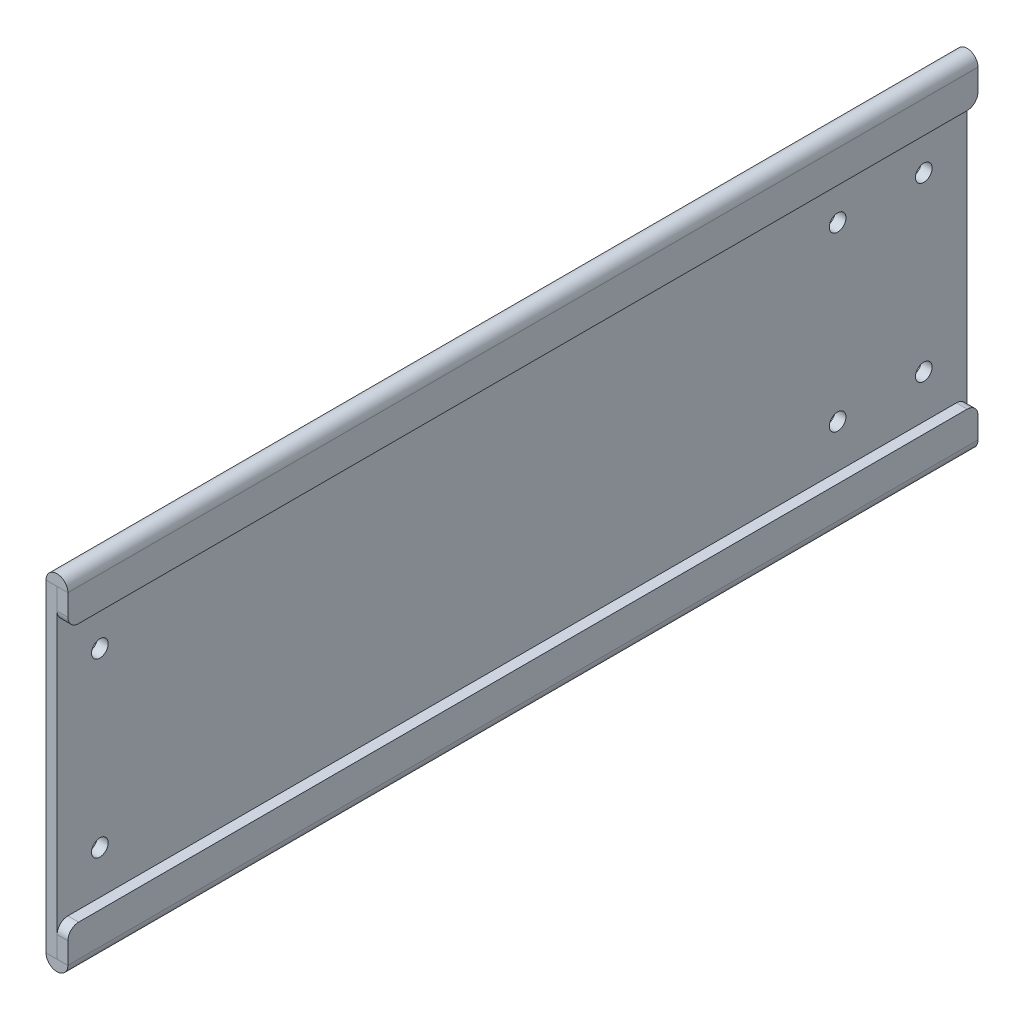
ISO-10303-21;
HEADER;
FILE_DESCRIPTION(('STEP AP214'),'2;1');
FILE_NAME('part.step','',(''),(''),'','','');
FILE_SCHEMA(('AUTOMOTIVE_DESIGN { 1 0 10303 214 1 1 1 1 }'));
ENDSEC;
DATA;
#1=APPLICATION_CONTEXT('core data for automotive mechanical design processes');
#2=APPLICATION_PROTOCOL_DEFINITION('international standard','automotive_design',2000,#1);
#3=PRODUCT_CONTEXT('',#1,'mechanical');
#4=PRODUCT('Part','Part','',(#3));
#5=PRODUCT_RELATED_PRODUCT_CATEGORY('part','',(#4));
#6=PRODUCT_DEFINITION_FORMATION('','',#4);
#7=PRODUCT_DEFINITION_CONTEXT('part definition',#1,'design');
#8=PRODUCT_DEFINITION('design','',#6,#7);
#9=PRODUCT_DEFINITION_SHAPE('','',#8);
#10=(LENGTH_UNIT() NAMED_UNIT(*) SI_UNIT(.MILLI.,.METRE.));
#11=(NAMED_UNIT(*) PLANE_ANGLE_UNIT() SI_UNIT($,.RADIAN.));
#12=(NAMED_UNIT(*) SI_UNIT($,.STERADIAN.) SOLID_ANGLE_UNIT());
#13=UNCERTAINTY_MEASURE_WITH_UNIT(LENGTH_MEASURE(1.E-05),#10,'distance_accuracy_value','');
#14=(GEOMETRIC_REPRESENTATION_CONTEXT(3) GLOBAL_UNCERTAINTY_ASSIGNED_CONTEXT((#13)) GLOBAL_UNIT_ASSIGNED_CONTEXT((#10,
#11,#12)) REPRESENTATION_CONTEXT('',''));
#15=CARTESIAN_POINT('',(0.,0.,0.));
#16=DIRECTION('',(0.,0.,1.));
#17=DIRECTION('',(1.,0.,0.));
#18=AXIS2_PLACEMENT_3D('',#15,#16,#17);
#19=CARTESIAN_POINT('',(0.,101.6,-268.22908));
#20=DIRECTION('',(0.,0.,-1.));
#21=DIRECTION('',(-1.,0.,0.));
#22=AXIS2_PLACEMENT_3D('',#19,#20,#21);
#23=PLANE('',#22);
#24=DIRECTION('',(0.,-1.,0.));
#25=VECTOR('',#24,1.);
#26=CARTESIAN_POINT('',(3.175,101.6,-268.22908));
#27=LINE('',#26,#25);
#28=CARTESIAN_POINT('',(3.175,98.375,-268.22908));
#29=VERTEX_POINT('',#28);
#30=CARTESIAN_POINT('',(3.175,3.22500000000001,-268.22908));
#31=VERTEX_POINT('',#30);
#32=EDGE_CURVE('E208',#29,#31,#27,.T.);
#33=ORIENTED_EDGE('',*,*,#32,.T.);
#34=DIRECTION('',(-1.,0.,0.));
#35=VECTOR('',#34,1.);
#36=CARTESIAN_POINT('',(3.175,3.225,-268.22908));
#37=LINE('',#36,#35);
#38=CARTESIAN_POINT('',(0.,3.22500000000003,-268.22908));
#39=VERTEX_POINT('',#38);
#40=EDGE_CURVE('E173',#31,#39,#37,.T.);
#41=ORIENTED_EDGE('',*,*,#40,.T.);
#42=DIRECTION('',(0.,-1.,0.));
#43=VECTOR('',#42,1.);
#44=CARTESIAN_POINT('',(0.,101.6,-268.22908));
#45=LINE('',#44,#43);
#46=CARTESIAN_POINT('',(0.,98.375,-268.22908));
#47=VERTEX_POINT('',#46);
#48=EDGE_CURVE('E193',#47,#39,#45,.T.);
#49=ORIENTED_EDGE('',*,*,#48,.F.);
#50=DIRECTION('',(-1.,0.,0.));
#51=VECTOR('',#50,1.);
#52=CARTESIAN_POINT('',(3.175,98.375,-268.22908));
#53=LINE('',#52,#51);
#54=EDGE_CURVE('E280',#29,#47,#53,.T.);
#55=ORIENTED_EDGE('',*,*,#54,.F.);
#56=EDGE_LOOP('',(#33,#41,#49,#55));
#57=FACE_BOUND('',#56,.T.);
#58=ADVANCED_FACE('F42',(#57),#23,.T.);
#59=CARTESIAN_POINT('',(3.175,101.6,0.));
#60=DIRECTION('',(0.,0.,1.));
#61=DIRECTION('',(1.,0.,0.));
#62=AXIS2_PLACEMENT_3D('',#59,#60,#61);
#63=PLANE('',#62);
#64=DIRECTION('',(-1.,0.,0.));
#65=VECTOR('',#64,1.);
#66=CARTESIAN_POINT('',(3.175,3.225,0.));
#67=LINE('',#66,#65);
#68=CARTESIAN_POINT('',(3.175,3.225,0.));
#69=VERTEX_POINT('',#68);
#70=CARTESIAN_POINT('',(0.,3.22500000000003,0.));
#71=VERTEX_POINT('',#70);
#72=EDGE_CURVE('E160',#69,#71,#67,.T.);
#73=ORIENTED_EDGE('',*,*,#72,.F.);
#74=DIRECTION('',(0.,-1.,0.));
#75=VECTOR('',#74,1.);
#76=CARTESIAN_POINT('',(3.175,101.6,0.));
#77=LINE('',#76,#75);
#78=CARTESIAN_POINT('',(3.175,98.375,0.));
#79=VERTEX_POINT('',#78);
#80=EDGE_CURVE('E203',#79,#69,#77,.T.);
#81=ORIENTED_EDGE('',*,*,#80,.F.);
#82=DIRECTION('',(-1.,0.,0.));
#83=VECTOR('',#82,1.);
#84=CARTESIAN_POINT('',(3.175,98.375,0.));
#85=LINE('',#84,#83);
#86=CARTESIAN_POINT('',(0.,98.375,0.));
#87=VERTEX_POINT('',#86);
#88=EDGE_CURVE('E201',#79,#87,#85,.T.);
#89=ORIENTED_EDGE('',*,*,#88,.T.);
#90=DIRECTION('',(0.,-1.,0.));
#91=VECTOR('',#90,1.);
#92=CARTESIAN_POINT('',(0.,101.6,0.));
#93=LINE('',#92,#91);
#94=EDGE_CURVE('E191',#87,#71,#93,.T.);
#95=ORIENTED_EDGE('',*,*,#94,.T.);
#96=EDGE_LOOP('',(#73,#81,#89,#95));
#97=FACE_BOUND('',#96,.T.);
#98=ADVANCED_FACE('F199',(#97),#63,.T.);
#99=CARTESIAN_POINT('',(3.175,101.6,0.));
#100=DIRECTION('',(-1.,0.,0.));
#101=DIRECTION('',(0.,0.,1.));
#102=AXIS2_PLACEMENT_3D('',#99,#100,#101);
#103=PLANE('',#102);
#104=CARTESIAN_POINT('',(3.175,25.35,-255.52908));
#105=DIRECTION('',(-1.,0.,0.));
#106=DIRECTION('',(0.,0.,1.));
#107=AXIS2_PLACEMENT_3D('',#104,#105,#106);
#108=CIRCLE('',#107,2.45745000000002);
#109=CARTESIAN_POINT('',(3.175,25.35,-253.07163));
#110=VERTEX_POINT('',#109);
#111=EDGE_CURVE('E405',#110,#110,#108,.T.);
#112=ORIENTED_EDGE('',*,*,#111,.T.);
#113=EDGE_LOOP('',(#112));
#114=FACE_BOUND('',#113,.T.);
#115=CARTESIAN_POINT('',(3.175,25.35,-230.12908));
#116=DIRECTION('',(-1.,0.,0.));
#117=DIRECTION('',(0.,0.,1.));
#118=AXIS2_PLACEMENT_3D('',#115,#116,#117);
#119=CIRCLE('',#118,2.45744999999999);
#120=CARTESIAN_POINT('',(3.175,25.35,-227.67163));
#121=VERTEX_POINT('',#120);
#122=EDGE_CURVE('E415',#121,#121,#119,.T.);
#123=ORIENTED_EDGE('',*,*,#122,.T.);
#124=EDGE_LOOP('',(#123));
#125=FACE_BOUND('',#124,.T.);
#126=CARTESIAN_POINT('',(3.175,76.15,-230.12908));
#127=DIRECTION('',(-1.,0.,0.));
#128=DIRECTION('',(0.,0.,1.));
#129=AXIS2_PLACEMENT_3D('',#126,#127,#128);
#130=CIRCLE('',#129,2.45744999999999);
#131=CARTESIAN_POINT('',(3.175,76.15,-227.67163));
#132=VERTEX_POINT('',#131);
#133=EDGE_CURVE('E419',#132,#132,#130,.T.);
#134=ORIENTED_EDGE('',*,*,#133,.T.);
#135=EDGE_LOOP('',(#134));
#136=FACE_BOUND('',#135,.T.);
#137=CARTESIAN_POINT('',(3.175,76.15,-12.7));
#138=DIRECTION('',(-1.,0.,0.));
#139=DIRECTION('',(0.,0.,1.));
#140=AXIS2_PLACEMENT_3D('',#137,#138,#139);
#141=CIRCLE('',#140,2.45745);
#142=CARTESIAN_POINT('',(3.175,76.15,-10.24255));
#143=VERTEX_POINT('',#142);
#144=EDGE_CURVE('E423',#143,#143,#141,.T.);
#145=ORIENTED_EDGE('',*,*,#144,.T.);
#146=EDGE_LOOP('',(#145));
#147=FACE_BOUND('',#146,.T.);
#148=CARTESIAN_POINT('',(3.175,25.35,-12.7));
#149=DIRECTION('',(-1.,0.,0.));
#150=DIRECTION('',(0.,0.,1.));
#151=AXIS2_PLACEMENT_3D('',#148,#149,#150);
#152=CIRCLE('',#151,2.45745);
#153=CARTESIAN_POINT('',(3.175,25.35,-10.24255));
#154=VERTEX_POINT('',#153);
#155=EDGE_CURVE('E427',#154,#154,#152,.T.);
#156=ORIENTED_EDGE('',*,*,#155,.T.);
#157=EDGE_LOOP('',(#156));
#158=FACE_BOUND('',#157,.T.);
#159=CARTESIAN_POINT('',(3.175,76.15,-255.52908));
#160=DIRECTION('',(-1.,0.,0.));
#161=DIRECTION('',(0.,0.,1.));
#162=AXIS2_PLACEMENT_3D('',#159,#160,#161);
#163=CIRCLE('',#162,2.45745000000002);
#164=CARTESIAN_POINT('',(3.175,76.15,-253.07163));
#165=VERTEX_POINT('',#164);
#166=EDGE_CURVE('E431',#165,#165,#163,.T.);
#167=ORIENTED_EDGE('',*,*,#166,.T.);
#168=EDGE_LOOP('',(#167));
#169=FACE_BOUND('',#168,.T.);
#170=ORIENTED_EDGE('',*,*,#80,.T.);
#171=DIRECTION('',(0.,0.,-1.));
#172=VECTOR('',#171,1.);
#173=CARTESIAN_POINT('',(3.175,3.225,-268.22908));
#174=LINE('',#173,#172);
#175=EDGE_CURVE('E404',#31,#69,#174,.F.);
#176=ORIENTED_EDGE('',*,*,#175,.F.);
#177=ORIENTED_EDGE('',*,*,#32,.F.);
#178=DIRECTION('',(0.,0.,1.));
#179=VECTOR('',#178,1.);
#180=CARTESIAN_POINT('',(3.175,98.375,0.));
#181=LINE('',#180,#179);
#182=EDGE_CURVE('E349',#79,#29,#181,.F.);
#183=ORIENTED_EDGE('',*,*,#182,.F.);
#184=EDGE_LOOP('',(#170,#176,#177,#183));
#185=FACE_BOUND('',#184,.T.);
#186=ADVANCED_FACE('F467',(#114,#125,#136,#147,#158,#169,#185),#103,.F.);
#187=CARTESIAN_POINT('',(0.,101.6,0.));
#188=DIRECTION('',(-1.,0.,0.));
#189=DIRECTION('',(0.,0.,1.));
#190=AXIS2_PLACEMENT_3D('',#187,#188,#189);
#191=PLANE('',#190);
#192=CARTESIAN_POINT('',(0.,25.35,-255.52908));
#193=DIRECTION('',(-1.,0.,0.));
#194=DIRECTION('',(0.,0.,1.));
#195=AXIS2_PLACEMENT_3D('',#192,#193,#194);
#196=CIRCLE('',#195,2.45745000000002);
#197=CARTESIAN_POINT('',(0.,25.35,-253.07163));
#198=VERTEX_POINT('',#197);
#199=EDGE_CURVE('E439',#198,#198,#196,.T.);
#200=ORIENTED_EDGE('',*,*,#199,.F.);
#201=EDGE_LOOP('',(#200));
#202=FACE_BOUND('',#201,.T.);
#203=CARTESIAN_POINT('',(0.,25.35,-230.12908));
#204=DIRECTION('',(-1.,0.,0.));
#205=DIRECTION('',(0.,0.,1.));
#206=AXIS2_PLACEMENT_3D('',#203,#204,#205);
#207=CIRCLE('',#206,2.45744999999999);
#208=CARTESIAN_POINT('',(0.,25.35,-227.67163));
#209=VERTEX_POINT('',#208);
#210=EDGE_CURVE('E449',#209,#209,#207,.T.);
#211=ORIENTED_EDGE('',*,*,#210,.F.);
#212=EDGE_LOOP('',(#211));
#213=FACE_BOUND('',#212,.T.);
#214=CARTESIAN_POINT('',(0.,76.15,-230.12908));
#215=DIRECTION('',(-1.,0.,0.));
#216=DIRECTION('',(0.,0.,1.));
#217=AXIS2_PLACEMENT_3D('',#214,#215,#216);
#218=CIRCLE('',#217,2.45744999999999);
#219=CARTESIAN_POINT('',(0.,76.15,-227.67163));
#220=VERTEX_POINT('',#219);
#221=EDGE_CURVE('E444',#220,#220,#218,.T.);
#222=ORIENTED_EDGE('',*,*,#221,.F.);
#223=EDGE_LOOP('',(#222));
#224=FACE_BOUND('',#223,.T.);
#225=CARTESIAN_POINT('',(0.,76.15,-12.7));
#226=DIRECTION('',(-1.,0.,0.));
#227=DIRECTION('',(0.,0.,1.));
#228=AXIS2_PLACEMENT_3D('',#225,#226,#227);
#229=CIRCLE('',#228,2.45745);
#230=CARTESIAN_POINT('',(0.,76.15,-10.24255));
#231=VERTEX_POINT('',#230);
#232=EDGE_CURVE('E440',#231,#231,#229,.T.);
#233=ORIENTED_EDGE('',*,*,#232,.F.);
#234=EDGE_LOOP('',(#233));
#235=FACE_BOUND('',#234,.T.);
#236=CARTESIAN_POINT('',(0.,25.35,-12.7));
#237=DIRECTION('',(-1.,0.,0.));
#238=DIRECTION('',(0.,0.,1.));
#239=AXIS2_PLACEMENT_3D('',#236,#237,#238);
#240=CIRCLE('',#239,2.45745);
#241=CARTESIAN_POINT('',(0.,25.35,-10.24255));
#242=VERTEX_POINT('',#241);
#243=EDGE_CURVE('E445',#242,#242,#240,.T.);
#244=ORIENTED_EDGE('',*,*,#243,.F.);
#245=EDGE_LOOP('',(#244));
#246=FACE_BOUND('',#245,.T.);
#247=CARTESIAN_POINT('',(0.,76.15,-255.52908));
#248=DIRECTION('',(-1.,0.,0.));
#249=DIRECTION('',(0.,0.,1.));
#250=AXIS2_PLACEMENT_3D('',#247,#248,#249);
#251=CIRCLE('',#250,2.45745000000002);
#252=CARTESIAN_POINT('',(0.,76.15,-253.07163));
#253=VERTEX_POINT('',#252);
#254=EDGE_CURVE('E435',#253,#253,#251,.T.);
#255=ORIENTED_EDGE('',*,*,#254,.F.);
#256=EDGE_LOOP('',(#255));
#257=FACE_BOUND('',#256,.T.);
#258=DIRECTION('',(0.,0.,-1.));
#259=VECTOR('',#258,1.);
#260=CARTESIAN_POINT('',(0.,3.22500000000003,-268.22908));
#261=LINE('',#260,#259);
#262=EDGE_CURVE('E180',#39,#71,#261,.F.);
#263=ORIENTED_EDGE('',*,*,#262,.T.);
#264=ORIENTED_EDGE('',*,*,#94,.F.);
#265=DIRECTION('',(0.,0.,1.));
#266=VECTOR('',#265,1.);
#267=CARTESIAN_POINT('',(0.,98.375,0.));
#268=LINE('',#267,#266);
#269=EDGE_CURVE('E336',#87,#47,#268,.F.);
#270=ORIENTED_EDGE('',*,*,#269,.T.);
#271=ORIENTED_EDGE('',*,*,#48,.T.);
#272=EDGE_LOOP('',(#263,#264,#270,#271));
#273=FACE_BOUND('',#272,.T.);
#274=ADVANCED_FACE('F189',(#202,#213,#224,#235,#246,#257,#273),#191,.T.);
#275=CARTESIAN_POINT('',(6.45,93.6375,0.));
#276=DIRECTION('',(0.,0.,-1.));
#277=DIRECTION('',(0.,1.,0.));
#278=AXIS2_PLACEMENT_3D('',#275,#276,#277);
#279=PLANE('',#278);
#280=DIRECTION('',(0.,1.,0.));
#281=VECTOR('',#280,1.);
#282=CARTESIAN_POINT('',(3.275,93.6375,0.));
#283=LINE('',#282,#281);
#284=CARTESIAN_POINT('',(3.275,92.075,0.));
#285=VERTEX_POINT('',#284);
#286=CARTESIAN_POINT('',(3.275,98.375,0.));
#287=VERTEX_POINT('',#286);
#288=EDGE_CURVE('E315',#285,#287,#283,.T.);
#289=ORIENTED_EDGE('',*,*,#288,.F.);
#290=DIRECTION('',(-1.,0.,0.));
#291=VECTOR('',#290,1.);
#292=CARTESIAN_POINT('',(6.45,92.075,0.));
#293=LINE('',#292,#291);
#294=CARTESIAN_POINT('',(6.45,92.075,0.));
#295=VERTEX_POINT('',#294);
#296=EDGE_CURVE('E217',#285,#295,#293,.F.);
#297=ORIENTED_EDGE('',*,*,#296,.T.);
#298=DIRECTION('',(0.,1.,0.));
#299=VECTOR('',#298,1.);
#300=CARTESIAN_POINT('',(6.45,93.6375,0.));
#301=LINE('',#300,#299);
#302=CARTESIAN_POINT('',(6.45,98.375,0.));
#303=VERTEX_POINT('',#302);
#304=EDGE_CURVE('E296',#295,#303,#301,.T.);
#305=ORIENTED_EDGE('',*,*,#304,.T.);
#306=DIRECTION('',(1.,0.,0.));
#307=VECTOR('',#306,1.);
#308=CARTESIAN_POINT('',(6.45,98.375,0.));
#309=LINE('',#308,#307);
#310=EDGE_CURVE('E295',#287,#303,#309,.T.);
#311=ORIENTED_EDGE('',*,*,#310,.F.);
#312=EDGE_LOOP('',(#289,#297,#305,#311));
#313=FACE_BOUND('',#312,.T.);
#314=ADVANCED_FACE('F466',(#313),#279,.F.);
#315=CARTESIAN_POINT('',(6.45,88.9,-134.11454));
#316=DIRECTION('',(0.,1.,0.));
#317=DIRECTION('',(0.,0.,1.));
#318=AXIS2_PLACEMENT_3D('',#315,#316,#317);
#319=PLANE('',#318);
#320=DIRECTION('',(0.,0.,1.));
#321=VECTOR('',#320,1.);
#322=CARTESIAN_POINT('',(6.45,88.9,-134.11454));
#323=LINE('',#322,#321);
#324=CARTESIAN_POINT('',(6.45,88.9,-265.05408));
#325=VERTEX_POINT('',#324);
#326=CARTESIAN_POINT('',(6.45,88.9,-3.17500000000001));
#327=VERTEX_POINT('',#326);
#328=EDGE_CURVE('E288',#325,#327,#323,.T.);
#329=ORIENTED_EDGE('',*,*,#328,.T.);
#330=DIRECTION('',(-1.,0.,0.));
#331=VECTOR('',#330,1.);
#332=CARTESIAN_POINT('',(6.45,88.9,-3.17500000000001));
#333=LINE('',#332,#331);
#334=CARTESIAN_POINT('',(3.275,88.9,-3.17500000000001));
#335=VERTEX_POINT('',#334);
#336=EDGE_CURVE('E231',#327,#335,#333,.T.);
#337=ORIENTED_EDGE('',*,*,#336,.T.);
#338=DIRECTION('',(0.,0.,-1.));
#339=VECTOR('',#338,1.);
#340=CARTESIAN_POINT('',(3.275,88.9,-134.11454));
#341=LINE('',#340,#339);
#342=CARTESIAN_POINT('',(3.275,88.9,-265.05408));
#343=VERTEX_POINT('',#342);
#344=EDGE_CURVE('E290',#343,#335,#341,.F.);
#345=ORIENTED_EDGE('',*,*,#344,.F.);
#346=DIRECTION('',(-1.,0.,0.));
#347=VECTOR('',#346,1.);
#348=CARTESIAN_POINT('',(6.45,88.9,-265.05408));
#349=LINE('',#348,#347);
#350=EDGE_CURVE('E227',#343,#325,#349,.F.);
#351=ORIENTED_EDGE('',*,*,#350,.T.);
#352=EDGE_LOOP('',(#329,#337,#345,#351));
#353=FACE_BOUND('',#352,.T.);
#354=ADVANCED_FACE('F287',(#353),#319,.F.);
#355=CARTESIAN_POINT('',(6.45,93.6375,-268.22908));
#356=DIRECTION('',(0.,0.,1.));
#357=DIRECTION('',(0.,-1.,0.));
#358=AXIS2_PLACEMENT_3D('',#355,#356,#357);
#359=PLANE('',#358);
#360=DIRECTION('',(0.,-1.,0.));
#361=VECTOR('',#360,1.);
#362=CARTESIAN_POINT('',(6.45,93.6375,-268.22908));
#363=LINE('',#362,#361);
#364=CARTESIAN_POINT('',(6.45,98.375,-268.22908));
#365=VERTEX_POINT('',#364);
#366=CARTESIAN_POINT('',(6.45,92.075,-268.22908));
#367=VERTEX_POINT('',#366);
#368=EDGE_CURVE('E270',#365,#367,#363,.T.);
#369=ORIENTED_EDGE('',*,*,#368,.T.);
#370=DIRECTION('',(-1.,0.,0.));
#371=VECTOR('',#370,1.);
#372=CARTESIAN_POINT('',(6.45,92.075,-268.22908));
#373=LINE('',#372,#371);
#374=CARTESIAN_POINT('',(3.275,92.075,-268.22908));
#375=VERTEX_POINT('',#374);
#376=EDGE_CURVE('E51',#367,#375,#373,.T.);
#377=ORIENTED_EDGE('',*,*,#376,.T.);
#378=DIRECTION('',(0.,1.,0.));
#379=VECTOR('',#378,1.);
#380=CARTESIAN_POINT('',(3.275,93.6375,-268.22908));
#381=LINE('',#380,#379);
#382=CARTESIAN_POINT('',(3.275,98.375,-268.22908));
#383=VERTEX_POINT('',#382);
#384=EDGE_CURVE('E268',#383,#375,#381,.F.);
#385=ORIENTED_EDGE('',*,*,#384,.F.);
#386=DIRECTION('',(1.,0.,0.));
#387=VECTOR('',#386,1.);
#388=CARTESIAN_POINT('',(6.45,98.375,-268.22908));
#389=LINE('',#388,#387);
#390=EDGE_CURVE('E210',#383,#365,#389,.T.);
#391=ORIENTED_EDGE('',*,*,#390,.T.);
#392=EDGE_LOOP('',(#369,#377,#385,#391));
#393=FACE_BOUND('',#392,.T.);
#394=ADVANCED_FACE('F266',(#393),#359,.F.);
#395=CARTESIAN_POINT('',(6.45,93.6375,-134.11454));
#396=DIRECTION('',(1.,0.,0.));
#397=DIRECTION('',(0.,0.,-1.));
#398=AXIS2_PLACEMENT_3D('',#395,#396,#397);
#399=PLANE('',#398);
#400=ORIENTED_EDGE('',*,*,#304,.F.);
#401=CARTESIAN_POINT('',(6.45,92.075,-3.175));
#402=DIRECTION('',(1.,0.,0.));
#403=DIRECTION('',(0.,0.,-1.));
#404=AXIS2_PLACEMENT_3D('',#401,#402,#403);
#405=CIRCLE('',#404,3.175);
#406=EDGE_CURVE('E224',#295,#327,#405,.T.);
#407=ORIENTED_EDGE('',*,*,#406,.T.);
#408=ORIENTED_EDGE('',*,*,#328,.F.);
#409=CARTESIAN_POINT('',(6.45,92.075,-265.05408));
#410=DIRECTION('',(1.,0.,0.));
#411=DIRECTION('',(0.,0.,-1.));
#412=AXIS2_PLACEMENT_3D('',#409,#410,#411);
#413=CIRCLE('',#412,3.175);
#414=EDGE_CURVE('E221',#325,#367,#413,.T.);
#415=ORIENTED_EDGE('',*,*,#414,.T.);
#416=ORIENTED_EDGE('',*,*,#368,.F.);
#417=DIRECTION('',(0.,0.,-1.));
#418=VECTOR('',#417,1.);
#419=CARTESIAN_POINT('',(6.45,98.375,-134.11454));
#420=LINE('',#419,#418);
#421=EDGE_CURVE('E303',#303,#365,#420,.T.);
#422=ORIENTED_EDGE('',*,*,#421,.F.);
#423=EDGE_LOOP('',(#400,#407,#408,#415,#416,#422));
#424=FACE_BOUND('',#423,.T.);
#425=ADVANCED_FACE('F293',(#424),#399,.T.);
#426=CARTESIAN_POINT('',(3.275,93.6375,-134.11454));
#427=DIRECTION('',(1.,0.,0.));
#428=DIRECTION('',(0.,0.,-1.));
#429=AXIS2_PLACEMENT_3D('',#426,#427,#428);
#430=PLANE('',#429);
#431=ORIENTED_EDGE('',*,*,#344,.T.);
#432=CARTESIAN_POINT('',(3.275,92.075,-3.175));
#433=DIRECTION('',(1.,0.,0.));
#434=DIRECTION('',(0.,0.,-1.));
#435=AXIS2_PLACEMENT_3D('',#432,#433,#434);
#436=CIRCLE('',#435,3.175);
#437=EDGE_CURVE('E237',#335,#285,#436,.F.);
#438=ORIENTED_EDGE('',*,*,#437,.T.);
#439=ORIENTED_EDGE('',*,*,#288,.T.);
#440=DIRECTION('',(0.,0.,-1.));
#441=VECTOR('',#440,1.);
#442=CARTESIAN_POINT('',(3.275,98.375,-134.11454));
#443=LINE('',#442,#441);
#444=EDGE_CURVE('E278',#287,#383,#443,.T.);
#445=ORIENTED_EDGE('',*,*,#444,.T.);
#446=ORIENTED_EDGE('',*,*,#384,.T.);
#447=CARTESIAN_POINT('',(3.275,92.075,-265.05408));
#448=DIRECTION('',(1.,0.,0.));
#449=DIRECTION('',(0.,0.,-1.));
#450=AXIS2_PLACEMENT_3D('',#447,#448,#449);
#451=CIRCLE('',#450,3.175);
#452=EDGE_CURVE('E234',#375,#343,#451,.F.);
#453=ORIENTED_EDGE('',*,*,#452,.T.);
#454=EDGE_LOOP('',(#431,#438,#439,#445,#446,#453));
#455=FACE_BOUND('',#454,.T.);
#456=ADVANCED_FACE('F275',(#455),#430,.F.);
#457=CARTESIAN_POINT('',(3.225,98.375,-268.22908));
#458=DIRECTION('',(0.,0.,-1.));
#459=DIRECTION('',(-1.,0.,0.));
#460=AXIS2_PLACEMENT_3D('',#457,#458,#459);
#461=PLANE('',#460);
#462=ORIENTED_EDGE('',*,*,#390,.F.);
#463=CARTESIAN_POINT('',(3.225,98.375,-268.22908));
#464=DIRECTION('',(0.,0.,1.));
#465=DIRECTION('',(1.,0.,0.));
#466=AXIS2_PLACEMENT_3D('',#463,#464,#465);
#467=CIRCLE('',#466,0.0499999999999997);
#468=EDGE_CURVE('E346',#29,#383,#467,.F.);
#469=ORIENTED_EDGE('',*,*,#468,.F.);
#470=ORIENTED_EDGE('',*,*,#54,.T.);
#471=CARTESIAN_POINT('',(3.225,98.375,-268.22908));
#472=DIRECTION('',(0.,0.,1.));
#473=DIRECTION('',(1.,0.,0.));
#474=AXIS2_PLACEMENT_3D('',#471,#472,#473);
#475=CIRCLE('',#474,3.225);
#476=EDGE_CURVE('E330',#47,#365,#475,.F.);
#477=ORIENTED_EDGE('',*,*,#476,.T.);
#478=EDGE_LOOP('',(#462,#469,#470,#477));
#479=FACE_BOUND('',#478,.T.);
#480=ADVANCED_FACE('F333',(#479),#461,.T.);
#481=CARTESIAN_POINT('',(3.225,98.375,0.));
#482=DIRECTION('',(0.,0.,-1.));
#483=DIRECTION('',(-1.,0.,0.));
#484=AXIS2_PLACEMENT_3D('',#481,#482,#483);
#485=PLANE('',#484);
#486=CARTESIAN_POINT('',(3.225,98.375,0.));
#487=DIRECTION('',(0.,0.,1.));
#488=DIRECTION('',(1.,0.,0.));
#489=AXIS2_PLACEMENT_3D('',#486,#487,#488);
#490=CIRCLE('',#489,0.0499999999999997);
#491=EDGE_CURVE('E352',#287,#79,#490,.T.);
#492=ORIENTED_EDGE('',*,*,#491,.F.);
#493=ORIENTED_EDGE('',*,*,#310,.T.);
#494=CARTESIAN_POINT('',(3.225,98.375,0.));
#495=DIRECTION('',(0.,0.,1.));
#496=DIRECTION('',(1.,0.,0.));
#497=AXIS2_PLACEMENT_3D('',#494,#495,#496);
#498=CIRCLE('',#497,3.225);
#499=EDGE_CURVE('E332',#303,#87,#498,.T.);
#500=ORIENTED_EDGE('',*,*,#499,.T.);
#501=ORIENTED_EDGE('',*,*,#88,.F.);
#502=EDGE_LOOP('',(#492,#493,#500,#501));
#503=FACE_BOUND('',#502,.T.);
#504=ADVANCED_FACE('F695',(#503),#485,.F.);
#505=CARTESIAN_POINT('',(3.225,98.375,0.));
#506=DIRECTION('',(0.,0.,1.));
#507=DIRECTION('',(1.,0.,0.));
#508=AXIS2_PLACEMENT_3D('',#505,#506,#507);
#509=CYLINDRICAL_SURFACE('',#508,3.225);
#510=ORIENTED_EDGE('',*,*,#269,.F.);
#511=ORIENTED_EDGE('',*,*,#499,.F.);
#512=ORIENTED_EDGE('',*,*,#421,.T.);
#513=ORIENTED_EDGE('',*,*,#476,.F.);
#514=EDGE_LOOP('',(#510,#511,#512,#513));
#515=FACE_BOUND('',#514,.T.);
#516=ADVANCED_FACE('F329',(#515),#509,.T.);
#517=CARTESIAN_POINT('',(3.225,98.375,0.));
#518=DIRECTION('',(0.,0.,1.));
#519=DIRECTION('',(1.,0.,0.));
#520=AXIS2_PLACEMENT_3D('',#517,#518,#519);
#521=CYLINDRICAL_SURFACE('',#520,0.0499999999999997);
#522=ORIENTED_EDGE('',*,*,#182,.T.);
#523=ORIENTED_EDGE('',*,*,#468,.T.);
#524=ORIENTED_EDGE('',*,*,#444,.F.);
#525=ORIENTED_EDGE('',*,*,#491,.T.);
#526=EDGE_LOOP('',(#522,#523,#524,#525));
#527=FACE_BOUND('',#526,.T.);
#528=ADVANCED_FACE('F486',(#527),#521,.F.);
#529=CARTESIAN_POINT('',(6.45,7.9625,-268.22908));
#530=DIRECTION('',(0.,0.,1.));
#531=DIRECTION('',(0.,-1.,0.));
#532=AXIS2_PLACEMENT_3D('',#529,#530,#531);
#533=PLANE('',#532);
#534=DIRECTION('',(0.,1.,0.));
#535=VECTOR('',#534,1.);
#536=CARTESIAN_POINT('',(3.275,7.9625,-268.22908));
#537=LINE('',#536,#535);
#538=CARTESIAN_POINT('',(3.275,9.525,-268.22908));
#539=VERTEX_POINT('',#538);
#540=CARTESIAN_POINT('',(3.275,3.225,-268.22908));
#541=VERTEX_POINT('',#540);
#542=EDGE_CURVE('E382',#539,#541,#537,.F.);
#543=ORIENTED_EDGE('',*,*,#542,.F.);
#544=DIRECTION('',(-1.,0.,0.));
#545=VECTOR('',#544,1.);
#546=CARTESIAN_POINT('',(6.45,9.525,-268.22908));
#547=LINE('',#546,#545);
#548=CARTESIAN_POINT('',(6.45,9.525,-268.22908));
#549=VERTEX_POINT('',#548);
#550=EDGE_CURVE('E11',#539,#549,#547,.F.);
#551=ORIENTED_EDGE('',*,*,#550,.T.);
#552=DIRECTION('',(0.,-1.,0.));
#553=VECTOR('',#552,1.);
#554=CARTESIAN_POINT('',(6.45,7.9625,-268.22908));
#555=LINE('',#554,#553);
#556=CARTESIAN_POINT('',(6.45,3.225,-268.22908));
#557=VERTEX_POINT('',#556);
#558=EDGE_CURVE('E393',#549,#557,#555,.T.);
#559=ORIENTED_EDGE('',*,*,#558,.T.);
#560=DIRECTION('',(1.,0.,0.));
#561=VECTOR('',#560,1.);
#562=CARTESIAN_POINT('',(6.45,3.225,-268.22908));
#563=LINE('',#562,#561);
#564=EDGE_CURVE('E370',#541,#557,#563,.T.);
#565=ORIENTED_EDGE('',*,*,#564,.F.);
#566=EDGE_LOOP('',(#543,#551,#559,#565));
#567=FACE_BOUND('',#566,.T.);
#568=ADVANCED_FACE('F495',(#567),#533,.F.);
#569=CARTESIAN_POINT('',(6.45,12.7,-134.11454));
#570=DIRECTION('',(0.,-1.,0.));
#571=DIRECTION('',(0.,0.,-1.));
#572=AXIS2_PLACEMENT_3D('',#569,#570,#571);
#573=PLANE('',#572);
#574=DIRECTION('',(0.,0.,-1.));
#575=VECTOR('',#574,1.);
#576=CARTESIAN_POINT('',(3.275,12.7,-134.11454));
#577=LINE('',#576,#575);
#578=CARTESIAN_POINT('',(3.275,12.7,-3.17500000000001));
#579=VERTEX_POINT('',#578);
#580=CARTESIAN_POINT('',(3.275,12.7,-265.05408));
#581=VERTEX_POINT('',#580);
#582=EDGE_CURVE('E385',#579,#581,#577,.T.);
#583=ORIENTED_EDGE('',*,*,#582,.F.);
#584=DIRECTION('',(-1.,0.,0.));
#585=VECTOR('',#584,1.);
#586=CARTESIAN_POINT('',(6.45,12.7,-3.17500000000001));
#587=LINE('',#586,#585);
#588=CARTESIAN_POINT('',(6.45,12.7,-3.17500000000001));
#589=VERTEX_POINT('',#588);
#590=EDGE_CURVE('E243',#579,#589,#587,.F.);
#591=ORIENTED_EDGE('',*,*,#590,.T.);
#592=DIRECTION('',(0.,0.,-1.));
#593=VECTOR('',#592,1.);
#594=CARTESIAN_POINT('',(6.45,12.7,-134.11454));
#595=LINE('',#594,#593);
#596=CARTESIAN_POINT('',(6.45,12.7,-265.05408));
#597=VERTEX_POINT('',#596);
#598=EDGE_CURVE('E374',#589,#597,#595,.T.);
#599=ORIENTED_EDGE('',*,*,#598,.T.);
#600=DIRECTION('',(-1.,0.,0.));
#601=VECTOR('',#600,1.);
#602=CARTESIAN_POINT('',(6.45,12.7,-265.05408));
#603=LINE('',#602,#601);
#604=EDGE_CURVE('E240',#597,#581,#603,.T.);
#605=ORIENTED_EDGE('',*,*,#604,.T.);
#606=EDGE_LOOP('',(#583,#591,#599,#605));
#607=FACE_BOUND('',#606,.T.);
#608=ADVANCED_FACE('F504',(#607),#573,.F.);
#609=CARTESIAN_POINT('',(6.45,7.9625,0.));
#610=DIRECTION('',(0.,0.,-1.));
#611=DIRECTION('',(0.,1.,0.));
#612=AXIS2_PLACEMENT_3D('',#609,#610,#611);
#613=PLANE('',#612);
#614=DIRECTION('',(0.,1.,0.));
#615=VECTOR('',#614,1.);
#616=CARTESIAN_POINT('',(6.45,7.9625,0.));
#617=LINE('',#616,#615);
#618=CARTESIAN_POINT('',(6.45,3.225,0.));
#619=VERTEX_POINT('',#618);
#620=CARTESIAN_POINT('',(6.45,9.525,0.));
#621=VERTEX_POINT('',#620);
#622=EDGE_CURVE('E388',#619,#621,#617,.T.);
#623=ORIENTED_EDGE('',*,*,#622,.T.);
#624=DIRECTION('',(-1.,0.,0.));
#625=VECTOR('',#624,1.);
#626=CARTESIAN_POINT('',(6.45,9.525,0.));
#627=LINE('',#626,#625);
#628=CARTESIAN_POINT('',(3.275,9.525,0.));
#629=VERTEX_POINT('',#628);
#630=EDGE_CURVE('E66',#621,#629,#627,.T.);
#631=ORIENTED_EDGE('',*,*,#630,.T.);
#632=DIRECTION('',(0.,1.,0.));
#633=VECTOR('',#632,1.);
#634=CARTESIAN_POINT('',(3.275,7.9625,0.));
#635=LINE('',#634,#633);
#636=CARTESIAN_POINT('',(3.275,3.225,0.));
#637=VERTEX_POINT('',#636);
#638=EDGE_CURVE('E172',#637,#629,#635,.T.);
#639=ORIENTED_EDGE('',*,*,#638,.F.);
#640=DIRECTION('',(1.,0.,0.));
#641=VECTOR('',#640,1.);
#642=CARTESIAN_POINT('',(6.45,3.225,0.));
#643=LINE('',#642,#641);
#644=EDGE_CURVE('E354',#637,#619,#643,.T.);
#645=ORIENTED_EDGE('',*,*,#644,.T.);
#646=EDGE_LOOP('',(#623,#631,#639,#645));
#647=FACE_BOUND('',#646,.T.);
#648=ADVANCED_FACE('F501',(#647),#613,.F.);
#649=CARTESIAN_POINT('',(6.45,7.9625,-134.11454));
#650=DIRECTION('',(1.,0.,0.));
#651=DIRECTION('',(0.,0.,-1.));
#652=AXIS2_PLACEMENT_3D('',#649,#650,#651);
#653=PLANE('',#652);
#654=ORIENTED_EDGE('',*,*,#598,.F.);
#655=CARTESIAN_POINT('',(6.45,9.525,-3.17500000000001));
#656=DIRECTION('',(1.,0.,0.));
#657=DIRECTION('',(0.,0.,-1.));
#658=AXIS2_PLACEMENT_3D('',#655,#656,#657);
#659=CIRCLE('',#658,3.175);
#660=EDGE_CURVE('E250',#589,#621,#659,.T.);
#661=ORIENTED_EDGE('',*,*,#660,.T.);
#662=ORIENTED_EDGE('',*,*,#622,.F.);
#663=DIRECTION('',(0.,0.,1.));
#664=VECTOR('',#663,1.);
#665=CARTESIAN_POINT('',(6.45,3.225,-134.11454));
#666=LINE('',#665,#664);
#667=EDGE_CURVE('E183',#557,#619,#666,.T.);
#668=ORIENTED_EDGE('',*,*,#667,.F.);
#669=ORIENTED_EDGE('',*,*,#558,.F.);
#670=CARTESIAN_POINT('',(6.45,9.525,-265.05408));
#671=DIRECTION('',(1.,0.,0.));
#672=DIRECTION('',(0.,0.,-1.));
#673=AXIS2_PLACEMENT_3D('',#670,#671,#672);
#674=CIRCLE('',#673,3.175);
#675=EDGE_CURVE('E247',#549,#597,#674,.T.);
#676=ORIENTED_EDGE('',*,*,#675,.T.);
#677=EDGE_LOOP('',(#654,#661,#662,#668,#669,#676));
#678=FACE_BOUND('',#677,.T.);
#679=ADVANCED_FACE('F503',(#678),#653,.T.);
#680=CARTESIAN_POINT('',(3.275,7.9625,-134.11454));
#681=DIRECTION('',(1.,0.,0.));
#682=DIRECTION('',(0.,0.,-1.));
#683=AXIS2_PLACEMENT_3D('',#680,#681,#682);
#684=PLANE('',#683);
#685=ORIENTED_EDGE('',*,*,#638,.T.);
#686=CARTESIAN_POINT('',(3.275,9.525,-3.17500000000001));
#687=DIRECTION('',(1.,0.,0.));
#688=DIRECTION('',(0.,0.,-1.));
#689=AXIS2_PLACEMENT_3D('',#686,#687,#688);
#690=CIRCLE('',#689,3.175);
#691=EDGE_CURVE('E257',#629,#579,#690,.F.);
#692=ORIENTED_EDGE('',*,*,#691,.T.);
#693=ORIENTED_EDGE('',*,*,#582,.T.);
#694=CARTESIAN_POINT('',(3.275,9.525,-265.05408));
#695=DIRECTION('',(1.,0.,0.));
#696=DIRECTION('',(0.,0.,-1.));
#697=AXIS2_PLACEMENT_3D('',#694,#695,#696);
#698=CIRCLE('',#697,3.175);
#699=EDGE_CURVE('E58',#581,#539,#698,.F.);
#700=ORIENTED_EDGE('',*,*,#699,.T.);
#701=ORIENTED_EDGE('',*,*,#542,.T.);
#702=DIRECTION('',(0.,0.,-1.));
#703=VECTOR('',#702,1.);
#704=CARTESIAN_POINT('',(3.275,3.225,-134.11454));
#705=LINE('',#704,#703);
#706=EDGE_CURVE('E379',#541,#637,#705,.F.);
#707=ORIENTED_EDGE('',*,*,#706,.T.);
#708=EDGE_LOOP('',(#685,#692,#693,#700,#701,#707));
#709=FACE_BOUND('',#708,.T.);
#710=ADVANCED_FACE('F499',(#709),#684,.F.);
#711=CARTESIAN_POINT('',(3.225,3.225,0.));
#712=DIRECTION('',(0.,0.,1.));
#713=DIRECTION('',(1.,0.,0.));
#714=AXIS2_PLACEMENT_3D('',#711,#712,#713);
#715=PLANE('',#714);
#716=ORIENTED_EDGE('',*,*,#644,.F.);
#717=CARTESIAN_POINT('',(3.225,3.225,0.));
#718=DIRECTION('',(0.,0.,-1.));
#719=DIRECTION('',(-1.,0.,0.));
#720=AXIS2_PLACEMENT_3D('',#717,#718,#719);
#721=CIRCLE('',#720,0.0499999999999997);
#722=EDGE_CURVE('E166',#69,#637,#721,.F.);
#723=ORIENTED_EDGE('',*,*,#722,.F.);
#724=ORIENTED_EDGE('',*,*,#72,.T.);
#725=CARTESIAN_POINT('',(3.225,3.225,0.));
#726=DIRECTION('',(0.,0.,-1.));
#727=DIRECTION('',(-1.,0.,0.));
#728=AXIS2_PLACEMENT_3D('',#725,#726,#727);
#729=CIRCLE('',#728,3.225);
#730=EDGE_CURVE('E164',#71,#619,#729,.F.);
#731=ORIENTED_EDGE('',*,*,#730,.T.);
#732=EDGE_LOOP('',(#716,#723,#724,#731));
#733=FACE_BOUND('',#732,.T.);
#734=ADVANCED_FACE('F163',(#733),#715,.T.);
#735=CARTESIAN_POINT('',(3.225,3.225,-268.22908));
#736=DIRECTION('',(0.,0.,1.));
#737=DIRECTION('',(1.,0.,0.));
#738=AXIS2_PLACEMENT_3D('',#735,#736,#737);
#739=PLANE('',#738);
#740=CARTESIAN_POINT('',(3.225,3.225,-268.22908));
#741=DIRECTION('',(0.,0.,-1.));
#742=DIRECTION('',(-1.,0.,0.));
#743=AXIS2_PLACEMENT_3D('',#740,#741,#742);
#744=CIRCLE('',#743,0.0499999999999997);
#745=EDGE_CURVE('E401',#541,#31,#744,.T.);
#746=ORIENTED_EDGE('',*,*,#745,.F.);
#747=ORIENTED_EDGE('',*,*,#564,.T.);
#748=CARTESIAN_POINT('',(3.225,3.225,-268.22908));
#749=DIRECTION('',(0.,0.,-1.));
#750=DIRECTION('',(-1.,0.,0.));
#751=AXIS2_PLACEMENT_3D('',#748,#749,#750);
#752=CIRCLE('',#751,3.225);
#753=EDGE_CURVE('E196',#557,#39,#752,.T.);
#754=ORIENTED_EDGE('',*,*,#753,.T.);
#755=ORIENTED_EDGE('',*,*,#40,.F.);
#756=EDGE_LOOP('',(#746,#747,#754,#755));
#757=FACE_BOUND('',#756,.T.);
#758=ADVANCED_FACE('F491',(#757),#739,.F.);
#759=CARTESIAN_POINT('',(3.225,3.225,-268.22908));
#760=DIRECTION('',(0.,0.,-1.));
#761=DIRECTION('',(1.,0.,0.));
#762=AXIS2_PLACEMENT_3D('',#759,#760,#761);
#763=CYLINDRICAL_SURFACE('',#762,3.225);
#764=ORIENTED_EDGE('',*,*,#262,.F.);
#765=ORIENTED_EDGE('',*,*,#753,.F.);
#766=ORIENTED_EDGE('',*,*,#667,.T.);
#767=ORIENTED_EDGE('',*,*,#730,.F.);
#768=EDGE_LOOP('',(#764,#765,#766,#767));
#769=FACE_BOUND('',#768,.T.);
#770=ADVANCED_FACE('F178',(#769),#763,.T.);
#771=CARTESIAN_POINT('',(3.225,3.225,-268.22908));
#772=DIRECTION('',(0.,0.,-1.));
#773=DIRECTION('',(1.,0.,0.));
#774=AXIS2_PLACEMENT_3D('',#771,#772,#773);
#775=CYLINDRICAL_SURFACE('',#774,0.0499999999999997);
#776=ORIENTED_EDGE('',*,*,#175,.T.);
#777=ORIENTED_EDGE('',*,*,#722,.T.);
#778=ORIENTED_EDGE('',*,*,#706,.F.);
#779=ORIENTED_EDGE('',*,*,#745,.T.);
#780=EDGE_LOOP('',(#776,#777,#778,#779));
#781=FACE_BOUND('',#780,.T.);
#782=ADVANCED_FACE('F475',(#781),#775,.F.);
#783=CARTESIAN_POINT('',(6.45,76.15,-255.52908));
#784=DIRECTION('',(-1.,0.,0.));
#785=DIRECTION('',(0.,0.,1.));
#786=AXIS2_PLACEMENT_3D('',#783,#784,#785);
#787=CYLINDRICAL_SURFACE('',#786,2.45745000000002);
#788=ORIENTED_EDGE('',*,*,#254,.T.);
#789=EDGE_LOOP('',(#788));
#790=FACE_BOUND('',#789,.T.);
#791=ORIENTED_EDGE('',*,*,#166,.F.);
#792=EDGE_LOOP('',(#791));
#793=FACE_BOUND('',#792,.T.);
#794=ADVANCED_FACE('F472',(#790,#793),#787,.F.);
#795=CARTESIAN_POINT('',(6.45,25.35,-12.7));
#796=DIRECTION('',(-1.,0.,0.));
#797=DIRECTION('',(0.,0.,1.));
#798=AXIS2_PLACEMENT_3D('',#795,#796,#797);
#799=CYLINDRICAL_SURFACE('',#798,2.45745);
#800=ORIENTED_EDGE('',*,*,#243,.T.);
#801=EDGE_LOOP('',(#800));
#802=FACE_BOUND('',#801,.T.);
#803=ORIENTED_EDGE('',*,*,#155,.F.);
#804=EDGE_LOOP('',(#803));
#805=FACE_BOUND('',#804,.T.);
#806=ADVANCED_FACE('F461',(#802,#805),#799,.F.);
#807=CARTESIAN_POINT('',(6.45,76.15,-12.7));
#808=DIRECTION('',(-1.,0.,0.));
#809=DIRECTION('',(0.,0.,1.));
#810=AXIS2_PLACEMENT_3D('',#807,#808,#809);
#811=CYLINDRICAL_SURFACE('',#810,2.45745);
#812=ORIENTED_EDGE('',*,*,#232,.T.);
#813=EDGE_LOOP('',(#812));
#814=FACE_BOUND('',#813,.T.);
#815=ORIENTED_EDGE('',*,*,#144,.F.);
#816=EDGE_LOOP('',(#815));
#817=FACE_BOUND('',#816,.T.);
#818=ADVANCED_FACE('F589',(#814,#817),#811,.F.);
#819=CARTESIAN_POINT('',(6.45,76.15,-230.12908));
#820=DIRECTION('',(-1.,0.,0.));
#821=DIRECTION('',(0.,0.,1.));
#822=AXIS2_PLACEMENT_3D('',#819,#820,#821);
#823=CYLINDRICAL_SURFACE('',#822,2.45744999999999);
#824=ORIENTED_EDGE('',*,*,#221,.T.);
#825=EDGE_LOOP('',(#824));
#826=FACE_BOUND('',#825,.T.);
#827=ORIENTED_EDGE('',*,*,#133,.F.);
#828=EDGE_LOOP('',(#827));
#829=FACE_BOUND('',#828,.T.);
#830=ADVANCED_FACE('F579',(#826,#829),#823,.F.);
#831=CARTESIAN_POINT('',(6.45,25.35,-230.12908));
#832=DIRECTION('',(-1.,0.,0.));
#833=DIRECTION('',(0.,0.,1.));
#834=AXIS2_PLACEMENT_3D('',#831,#832,#833);
#835=CYLINDRICAL_SURFACE('',#834,2.45744999999999);
#836=ORIENTED_EDGE('',*,*,#210,.T.);
#837=EDGE_LOOP('',(#836));
#838=FACE_BOUND('',#837,.T.);
#839=ORIENTED_EDGE('',*,*,#122,.F.);
#840=EDGE_LOOP('',(#839));
#841=FACE_BOUND('',#840,.T.);
#842=ADVANCED_FACE('F568',(#838,#841),#835,.F.);
#843=CARTESIAN_POINT('',(6.45,25.35,-255.52908));
#844=DIRECTION('',(-1.,0.,0.));
#845=DIRECTION('',(0.,0.,1.));
#846=AXIS2_PLACEMENT_3D('',#843,#844,#845);
#847=CYLINDRICAL_SURFACE('',#846,2.45745000000002);
#848=ORIENTED_EDGE('',*,*,#199,.T.);
#849=EDGE_LOOP('',(#848));
#850=FACE_BOUND('',#849,.T.);
#851=ORIENTED_EDGE('',*,*,#111,.F.);
#852=EDGE_LOOP('',(#851));
#853=FACE_BOUND('',#852,.T.);
#854=ADVANCED_FACE('F527',(#850,#853),#847,.F.);
#855=CARTESIAN_POINT('',(6.45,92.075,-3.175));
#856=DIRECTION('',(1.,0.,0.));
#857=DIRECTION('',(0.,0.,-1.));
#858=AXIS2_PLACEMENT_3D('',#855,#856,#857);
#859=CYLINDRICAL_SURFACE('',#858,3.175);
#860=ORIENTED_EDGE('',*,*,#437,.F.);
#861=ORIENTED_EDGE('',*,*,#336,.F.);
#862=ORIENTED_EDGE('',*,*,#406,.F.);
#863=ORIENTED_EDGE('',*,*,#296,.F.);
#864=EDGE_LOOP('',(#860,#861,#862,#863));
#865=FACE_BOUND('',#864,.T.);
#866=ADVANCED_FACE('F523',(#865),#859,.T.);
#867=CARTESIAN_POINT('',(6.45,9.525,-3.17500000000001));
#868=DIRECTION('',(1.,0.,0.));
#869=DIRECTION('',(0.,0.,-1.));
#870=AXIS2_PLACEMENT_3D('',#867,#868,#869);
#871=CYLINDRICAL_SURFACE('',#870,3.175);
#872=ORIENTED_EDGE('',*,*,#691,.F.);
#873=ORIENTED_EDGE('',*,*,#630,.F.);
#874=ORIENTED_EDGE('',*,*,#660,.F.);
#875=ORIENTED_EDGE('',*,*,#590,.F.);
#876=EDGE_LOOP('',(#872,#873,#874,#875));
#877=FACE_BOUND('',#876,.T.);
#878=ADVANCED_FACE('F526',(#877),#871,.T.);
#879=CARTESIAN_POINT('',(6.45,92.075,-265.05408));
#880=DIRECTION('',(1.,0.,0.));
#881=DIRECTION('',(0.,0.,-1.));
#882=AXIS2_PLACEMENT_3D('',#879,#880,#881);
#883=CYLINDRICAL_SURFACE('',#882,3.175);
#884=ORIENTED_EDGE('',*,*,#452,.F.);
#885=ORIENTED_EDGE('',*,*,#376,.F.);
#886=ORIENTED_EDGE('',*,*,#414,.F.);
#887=ORIENTED_EDGE('',*,*,#350,.F.);
#888=EDGE_LOOP('',(#884,#885,#886,#887));
#889=FACE_BOUND('',#888,.T.);
#890=ADVANCED_FACE('F283',(#889),#883,.T.);
#891=CARTESIAN_POINT('',(6.45,9.525,-265.05408));
#892=DIRECTION('',(1.,0.,0.));
#893=DIRECTION('',(0.,0.,-1.));
#894=AXIS2_PLACEMENT_3D('',#891,#892,#893);
#895=CYLINDRICAL_SURFACE('',#894,3.175);
#896=ORIENTED_EDGE('',*,*,#699,.F.);
#897=ORIENTED_EDGE('',*,*,#604,.F.);
#898=ORIENTED_EDGE('',*,*,#675,.F.);
#899=ORIENTED_EDGE('',*,*,#550,.F.);
#900=EDGE_LOOP('',(#896,#897,#898,#899));
#901=FACE_BOUND('',#900,.T.);
#902=ADVANCED_FACE('F44',(#901),#895,.T.);
#903=CLOSED_SHELL('',(#58,#98,#186,#274,#314,#354,#394,#425,#456,#480,#504,#516,#528,#568,#608,
#648,#679,#710,#734,#758,#770,#782,#794,#806,#818,#830,#842,#854,#866,#878,#890,#902));
#904=MANIFOLD_SOLID_BREP('B2',#903);
#905=ADVANCED_BREP_SHAPE_REPRESENTATION('',(#18,#904),#14);
#906=SHAPE_DEFINITION_REPRESENTATION(#9,#905);
ENDSEC;
END-ISO-10303-21;
